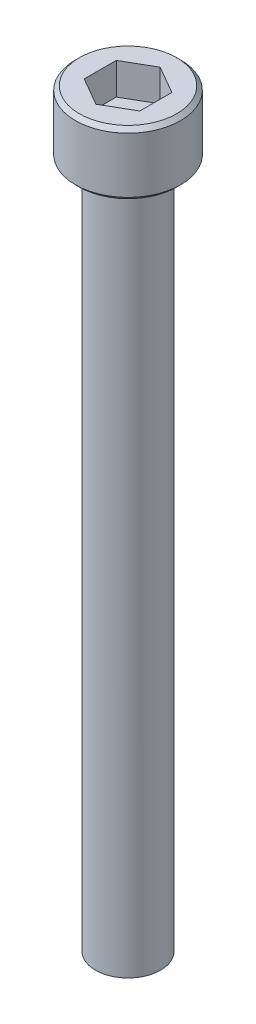
ISO-10303-21;
HEADER;
FILE_DESCRIPTION(('STEP AP214'),'2;1');
FILE_NAME('part.step','',(''),(''),'','','');
FILE_SCHEMA(('AUTOMOTIVE_DESIGN { 1 0 10303 214 1 1 1 1 }'));
ENDSEC;
DATA;
#1=APPLICATION_CONTEXT('core data for automotive mechanical design processes');
#2=APPLICATION_PROTOCOL_DEFINITION('international standard','automotive_design',2000,#1);
#3=PRODUCT_CONTEXT('',#1,'mechanical');
#4=PRODUCT('Part','Part','',(#3));
#5=PRODUCT_RELATED_PRODUCT_CATEGORY('part','',(#4));
#6=PRODUCT_DEFINITION_FORMATION('','',#4);
#7=PRODUCT_DEFINITION_CONTEXT('part definition',#1,'design');
#8=PRODUCT_DEFINITION('design','',#6,#7);
#9=PRODUCT_DEFINITION_SHAPE('','',#8);
#10=(LENGTH_UNIT() NAMED_UNIT(*) SI_UNIT(.MILLI.,.METRE.));
#11=(NAMED_UNIT(*) PLANE_ANGLE_UNIT() SI_UNIT($,.RADIAN.));
#12=(NAMED_UNIT(*) SI_UNIT($,.STERADIAN.) SOLID_ANGLE_UNIT());
#13=UNCERTAINTY_MEASURE_WITH_UNIT(LENGTH_MEASURE(1.E-05),#10,'distance_accuracy_value','');
#14=(GEOMETRIC_REPRESENTATION_CONTEXT(3) GLOBAL_UNCERTAINTY_ASSIGNED_CONTEXT((#13)) GLOBAL_UNIT_ASSIGNED_CONTEXT((#10,
#11,#12)) REPRESENTATION_CONTEXT('',''));
#15=CARTESIAN_POINT('',(0.,0.,0.));
#16=DIRECTION('',(0.,0.,1.));
#17=DIRECTION('',(1.,0.,0.));
#18=AXIS2_PLACEMENT_3D('',#15,#16,#17);
#19=CARTESIAN_POINT('',(1.778,2.032,3.07958633585746));
#20=DIRECTION('',(0.,1.,0.));
#21=DIRECTION('',(-1.,0.,0.));
#22=AXIS2_PLACEMENT_3D('',#19,#20,#21);
#23=PLANE('',#22);
#24=DIRECTION('',(-0.866025403784439,0.,0.5));
#25=VECTOR('',#24,1.);
#26=CARTESIAN_POINT('',(0.,2.032,-2.05305755723831));
#27=LINE('',#26,#25);
#28=CARTESIAN_POINT('',(0.,2.032,-2.05305755723831));
#29=VERTEX_POINT('',#28);
#30=CARTESIAN_POINT('',(-1.778,2.032,-1.02652877861914));
#31=VERTEX_POINT('',#30);
#32=EDGE_CURVE('E67',#29,#31,#27,.T.);
#33=ORIENTED_EDGE('',*,*,#32,.T.);
#34=DIRECTION('',(0.,0.,1.));
#35=VECTOR('',#34,1.);
#36=CARTESIAN_POINT('',(-1.778,2.032,-1.02652877861913));
#37=LINE('',#36,#35);
#38=CARTESIAN_POINT('',(-1.778,2.032,1.02652877861917));
#39=VERTEX_POINT('',#38);
#40=EDGE_CURVE('E69',#31,#39,#37,.T.);
#41=ORIENTED_EDGE('',*,*,#40,.T.);
#42=DIRECTION('',(0.866025403784439,0.,0.499999999999999));
#43=VECTOR('',#42,1.);
#44=CARTESIAN_POINT('',(-1.77799999999999,2.032,1.02652877861917));
#45=LINE('',#44,#43);
#46=CARTESIAN_POINT('',(0.,2.032,2.05305755723832));
#47=VERTEX_POINT('',#46);
#48=EDGE_CURVE('E71',#39,#47,#45,.T.);
#49=ORIENTED_EDGE('',*,*,#48,.T.);
#50=DIRECTION('',(0.866025403784439,0.,-0.5));
#51=VECTOR('',#50,1.);
#52=CARTESIAN_POINT('',(0.,2.032,2.05305755723831));
#53=LINE('',#52,#51);
#54=CARTESIAN_POINT('',(1.77800000000001,2.032,1.02652877861916));
#55=VERTEX_POINT('',#54);
#56=EDGE_CURVE('E126',#47,#55,#53,.T.);
#57=ORIENTED_EDGE('',*,*,#56,.T.);
#58=DIRECTION('',(0.,0.,-1.));
#59=VECTOR('',#58,1.);
#60=CARTESIAN_POINT('',(1.77800000000001,2.032,1.02652877861915));
#61=LINE('',#60,#59);
#62=CARTESIAN_POINT('',(1.77800000000001,2.032,-1.02652877861913));
#63=VERTEX_POINT('',#62);
#64=EDGE_CURVE('E131',#55,#63,#61,.T.);
#65=ORIENTED_EDGE('',*,*,#64,.T.);
#66=DIRECTION('',(-0.866025403784439,0.,-0.499999999999999));
#67=VECTOR('',#66,1.);
#68=CARTESIAN_POINT('',(1.77800000000001,2.032,-1.02652877861913));
#69=LINE('',#68,#67);
#70=EDGE_CURVE('E135',#63,#29,#69,.T.);
#71=ORIENTED_EDGE('',*,*,#70,.T.);
#72=EDGE_LOOP('',(#33,#41,#49,#57,#65,#71));
#73=FACE_BOUND('',#72,.T.);
#74=ADVANCED_FACE('F16',(#73),#23,.T.);
#75=CARTESIAN_POINT('',(-1.77799999999999,2.032,1.02652877861917));
#76=DIRECTION('',(-0.499999999999999,0.,0.866025403784439));
#77=DIRECTION('',(0.866025403784439,0.,0.499999999999999));
#78=AXIS2_PLACEMENT_3D('',#75,#76,#77);
#79=PLANE('',#78);
#80=DIRECTION('',(0.,1.,0.));
#81=VECTOR('',#80,1.);
#82=CARTESIAN_POINT('',(0.,2.032,2.05305755723831));
#83=LINE('',#82,#81);
#84=CARTESIAN_POINT('',(0.,4.064,2.05305755723832));
#85=VERTEX_POINT('',#84);
#86=EDGE_CURVE('E82',#85,#47,#83,.F.);
#87=ORIENTED_EDGE('',*,*,#86,.T.);
#88=ORIENTED_EDGE('',*,*,#48,.F.);
#89=DIRECTION('',(0.,1.,0.));
#90=VECTOR('',#89,1.);
#91=CARTESIAN_POINT('',(-1.778,2.032,1.02652877861917));
#92=LINE('',#91,#90);
#93=CARTESIAN_POINT('',(-1.77799999999999,4.064,1.02652877861917));
#94=VERTEX_POINT('',#93);
#95=EDGE_CURVE('E76',#39,#94,#92,.T.);
#96=ORIENTED_EDGE('',*,*,#95,.T.);
#97=DIRECTION('',(-0.866025403784442,0.,-0.499999999999994));
#98=VECTOR('',#97,1.);
#99=CARTESIAN_POINT('',(0.,4.064,2.05305755723831));
#100=LINE('',#99,#98);
#101=EDGE_CURVE('E123',#85,#94,#100,.T.);
#102=ORIENTED_EDGE('',*,*,#101,.F.);
#103=EDGE_LOOP('',(#87,#88,#96,#102));
#104=FACE_BOUND('',#103,.T.);
#105=ADVANCED_FACE('F79',(#104),#79,.F.);
#106=CARTESIAN_POINT('',(-1.778,2.032,-1.02652877861913));
#107=DIRECTION('',(-1.,0.,0.));
#108=DIRECTION('',(0.,0.,1.));
#109=AXIS2_PLACEMENT_3D('',#106,#107,#108);
#110=PLANE('',#109);
#111=ORIENTED_EDGE('',*,*,#95,.F.);
#112=ORIENTED_EDGE('',*,*,#40,.F.);
#113=DIRECTION('',(0.,1.,0.));
#114=VECTOR('',#113,1.);
#115=CARTESIAN_POINT('',(-1.77800000000001,2.032,-1.02652877861915));
#116=LINE('',#115,#114);
#117=CARTESIAN_POINT('',(-1.778,4.064,-1.02652877861914));
#118=VERTEX_POINT('',#117);
#119=EDGE_CURVE('E90',#31,#118,#116,.T.);
#120=ORIENTED_EDGE('',*,*,#119,.T.);
#121=DIRECTION('',(0.,0.,1.));
#122=VECTOR('',#121,1.);
#123=CARTESIAN_POINT('',(-1.77799999999999,4.064,0.));
#124=LINE('',#123,#122);
#125=EDGE_CURVE('E87',#94,#118,#124,.F.);
#126=ORIENTED_EDGE('',*,*,#125,.F.);
#127=EDGE_LOOP('',(#111,#112,#120,#126));
#128=FACE_BOUND('',#127,.T.);
#129=ADVANCED_FACE('F85',(#128),#110,.F.);
#130=CARTESIAN_POINT('',(0.,2.032,-2.05305755723831));
#131=DIRECTION('',(-0.5,0.,-0.866025403784439));
#132=DIRECTION('',(-0.866025403784439,0.,0.5));
#133=AXIS2_PLACEMENT_3D('',#130,#131,#132);
#134=PLANE('',#133);
#135=ORIENTED_EDGE('',*,*,#119,.F.);
#136=ORIENTED_EDGE('',*,*,#32,.F.);
#137=DIRECTION('',(0.,1.,0.));
#138=VECTOR('',#137,1.);
#139=CARTESIAN_POINT('',(0.,2.032,-2.05305755723829));
#140=LINE('',#139,#138);
#141=CARTESIAN_POINT('',(0.,4.064,-2.05305755723831));
#142=VERTEX_POINT('',#141);
#143=EDGE_CURVE('E133',#29,#142,#140,.T.);
#144=ORIENTED_EDGE('',*,*,#143,.T.);
#145=DIRECTION('',(0.866025403784434,0.,-0.500000000000007));
#146=VECTOR('',#145,1.);
#147=CARTESIAN_POINT('',(-1.778,4.064,-1.02652877861913));
#148=LINE('',#147,#146);
#149=EDGE_CURVE('E119',#118,#142,#148,.T.);
#150=ORIENTED_EDGE('',*,*,#149,.F.);
#151=EDGE_LOOP('',(#135,#136,#144,#150));
#152=FACE_BOUND('',#151,.T.);
#153=ADVANCED_FACE('F138',(#152),#134,.F.);
#154=CARTESIAN_POINT('',(1.77800000000001,2.032,-1.02652877861913));
#155=DIRECTION('',(0.499999999999999,0.,-0.866025403784439));
#156=DIRECTION('',(-0.866025403784439,0.,-0.499999999999999));
#157=AXIS2_PLACEMENT_3D('',#154,#155,#156);
#158=PLANE('',#157);
#159=ORIENTED_EDGE('',*,*,#143,.F.);
#160=ORIENTED_EDGE('',*,*,#70,.F.);
#161=DIRECTION('',(0.,1.,0.));
#162=VECTOR('',#161,1.);
#163=CARTESIAN_POINT('',(1.77800000000001,2.032,-1.02652877861913));
#164=LINE('',#163,#162);
#165=CARTESIAN_POINT('',(1.77800000000001,4.064,-1.02652877861913));
#166=VERTEX_POINT('',#165);
#167=EDGE_CURVE('E129',#63,#166,#164,.T.);
#168=ORIENTED_EDGE('',*,*,#167,.T.);
#169=DIRECTION('',(0.866025403784432,0.,0.500000000000011));
#170=VECTOR('',#169,1.);
#171=CARTESIAN_POINT('',(0.,4.064,-2.05305755723831));
#172=LINE('',#171,#170);
#173=EDGE_CURVE('E116',#142,#166,#172,.T.);
#174=ORIENTED_EDGE('',*,*,#173,.F.);
#175=EDGE_LOOP('',(#159,#160,#168,#174));
#176=FACE_BOUND('',#175,.T.);
#177=ADVANCED_FACE('F150',(#176),#158,.F.);
#178=CARTESIAN_POINT('',(1.77800000000001,2.032,1.02652877861915));
#179=DIRECTION('',(1.,0.,0.));
#180=DIRECTION('',(0.,0.,-1.));
#181=AXIS2_PLACEMENT_3D('',#178,#179,#180);
#182=PLANE('',#181);
#183=ORIENTED_EDGE('',*,*,#167,.F.);
#184=ORIENTED_EDGE('',*,*,#64,.F.);
#185=DIRECTION('',(0.,1.,0.));
#186=VECTOR('',#185,1.);
#187=CARTESIAN_POINT('',(1.77800000000001,2.032,1.02652877861916));
#188=LINE('',#187,#186);
#189=CARTESIAN_POINT('',(1.77800000000001,4.064,1.02652877861916));
#190=VERTEX_POINT('',#189);
#191=EDGE_CURVE('E34',#55,#190,#188,.T.);
#192=ORIENTED_EDGE('',*,*,#191,.T.);
#193=DIRECTION('',(0.,0.,1.));
#194=VECTOR('',#193,1.);
#195=CARTESIAN_POINT('',(1.77800000000001,4.064,0.));
#196=LINE('',#195,#194);
#197=EDGE_CURVE('E113',#166,#190,#196,.T.);
#198=ORIENTED_EDGE('',*,*,#197,.F.);
#199=EDGE_LOOP('',(#183,#184,#192,#198));
#200=FACE_BOUND('',#199,.T.);
#201=ADVANCED_FACE('F148',(#200),#182,.F.);
#202=CARTESIAN_POINT('',(0.,2.032,2.05305755723831));
#203=DIRECTION('',(0.5,0.,0.866025403784439));
#204=DIRECTION('',(0.866025403784439,0.,-0.5));
#205=AXIS2_PLACEMENT_3D('',#202,#203,#204);
#206=PLANE('',#205);
#207=ORIENTED_EDGE('',*,*,#191,.F.);
#208=ORIENTED_EDGE('',*,*,#56,.F.);
#209=ORIENTED_EDGE('',*,*,#86,.F.);
#210=DIRECTION('',(-0.866025403784437,0.,0.500000000000003));
#211=VECTOR('',#210,1.);
#212=CARTESIAN_POINT('',(1.77800000000001,4.064,1.02652877861915));
#213=LINE('',#212,#211);
#214=EDGE_CURVE('E110',#190,#85,#213,.T.);
#215=ORIENTED_EDGE('',*,*,#214,.F.);
#216=EDGE_LOOP('',(#207,#208,#209,#215));
#217=FACE_BOUND('',#216,.T.);
#218=ADVANCED_FACE('F145',(#217),#206,.F.);
#219=CARTESIAN_POINT('',(0.,4.064,0.));
#220=DIRECTION('',(0.,1.,0.));
#221=DIRECTION('',(-1.,0.,0.));
#222=AXIS2_PLACEMENT_3D('',#219,#220,#221);
#223=PLANE('',#222);
#224=ORIENTED_EDGE('',*,*,#197,.T.);
#225=ORIENTED_EDGE('',*,*,#214,.T.);
#226=ORIENTED_EDGE('',*,*,#101,.T.);
#227=ORIENTED_EDGE('',*,*,#125,.T.);
#228=ORIENTED_EDGE('',*,*,#149,.T.);
#229=ORIENTED_EDGE('',*,*,#173,.T.);
#230=EDGE_LOOP('',(#224,#225,#226,#227,#228,#229));
#231=FACE_BOUND('',#230,.T.);
#232=CARTESIAN_POINT('',(0.,4.06400000002805,0.));
#233=DIRECTION('',(0.,-1.,0.));
#234=DIRECTION('',(1.,0.,0.));
#235=AXIS2_PLACEMENT_3D('',#232,#233,#234);
#236=CIRCLE('',#235,3.11149999998861);
#237=CARTESIAN_POINT('',(3.11149999998861,4.06400000002805,0.));
#238=VERTEX_POINT('',#237);
#239=EDGE_CURVE('E19',#238,#238,#236,.T.);
#240=ORIENTED_EDGE('',*,*,#239,.F.);
#241=EDGE_LOOP('',(#240));
#242=FACE_BOUND('',#241,.T.);
#243=ADVANCED_FACE('F142',(#231,#242),#223,.T.);
#244=CARTESIAN_POINT('',(0.,3.81000000004406,0.));
#245=DIRECTION('',(0.,-1.,0.));
#246=DIRECTION('',(1.,0.,0.));
#247=AXIS2_PLACEMENT_3D('',#244,#245,#246);
#248=CONICAL_SURFACE('',#247,3.3654999999726,0.785398163397448);
#249=ORIENTED_EDGE('',*,*,#239,.T.);
#250=EDGE_LOOP('',(#249));
#251=FACE_BOUND('',#250,.T.);
#252=CARTESIAN_POINT('',(0.,3.81000000000001,0.));
#253=DIRECTION('',(0.,-1.,0.));
#254=DIRECTION('',(1.,0.,0.));
#255=AXIS2_PLACEMENT_3D('',#252,#253,#254);
#256=CIRCLE('',#255,3.3655);
#257=CARTESIAN_POINT('',(3.3655,3.81000000000001,0.));
#258=VERTEX_POINT('',#257);
#259=EDGE_CURVE('E102',#258,#258,#256,.T.);
#260=ORIENTED_EDGE('',*,*,#259,.F.);
#261=EDGE_LOOP('',(#260));
#262=FACE_BOUND('',#261,.T.);
#263=ADVANCED_FACE('F187',(#251,#262),#248,.T.);
#264=CARTESIAN_POINT('',(0.,4.064,0.));
#265=DIRECTION('',(0.,-1.,0.));
#266=DIRECTION('',(1.,0.,0.));
#267=AXIS2_PLACEMENT_3D('',#264,#265,#266);
#268=CYLINDRICAL_SURFACE('',#267,3.3655);
#269=ORIENTED_EDGE('',*,*,#259,.T.);
#270=EDGE_LOOP('',(#269));
#271=FACE_BOUND('',#270,.T.);
#272=CARTESIAN_POINT('',(0.,0.254000000097676,0.));
#273=DIRECTION('',(0.,1.,0.));
#274=DIRECTION('',(0.,0.,1.));
#275=AXIS2_PLACEMENT_3D('',#272,#273,#274);
#276=CIRCLE('',#275,3.36550000008629);
#277=CARTESIAN_POINT('',(0.,0.254000000097676,3.36550000008629));
#278=VERTEX_POINT('',#277);
#279=EDGE_CURVE('E98',#278,#278,#276,.F.);
#280=ORIENTED_EDGE('',*,*,#279,.F.);
#281=EDGE_LOOP('',(#280));
#282=FACE_BOUND('',#281,.T.);
#283=ADVANCED_FACE('F183',(#271,#282),#268,.T.);
#284=CARTESIAN_POINT('',(0.,-44.45,0.));
#285=DIRECTION('',(0.,1.,0.));
#286=DIRECTION('',(-1.,0.,0.));
#287=AXIS2_PLACEMENT_3D('',#284,#285,#286);
#288=PLANE('',#287);
#289=CARTESIAN_POINT('',(0.,-44.4499999999834,0.));
#290=DIRECTION('',(0.,1.,0.));
#291=DIRECTION('',(0.,0.,1.));
#292=AXIS2_PLACEMENT_3D('',#289,#290,#291);
#293=CIRCLE('',#292,1.31318000001102);
#294=CARTESIAN_POINT('',(0.,-44.4499999999834,1.31318000001102));
#295=VERTEX_POINT('',#294);
#296=EDGE_CURVE('E96',#295,#295,#293,.T.);
#297=ORIENTED_EDGE('',*,*,#296,.F.);
#298=EDGE_LOOP('',(#297));
#299=FACE_BOUND('',#298,.T.);
#300=ADVANCED_FACE('F179',(#299),#288,.F.);
#301=CARTESIAN_POINT('',(0.,0.253999999927146,0.));
#302=DIRECTION('',(0.,1.,0.));
#303=DIRECTION('',(0.,0.,1.));
#304=AXIS2_PLACEMENT_3D('',#301,#302,#303);
#305=CONICAL_SURFACE('',#304,3.36549999991576,0.785398163397448);
#306=CARTESIAN_POINT('',(0.,0.,0.));
#307=DIRECTION('',(0.,1.,0.));
#308=DIRECTION('',(0.,0.,1.));
#309=AXIS2_PLACEMENT_3D('',#306,#307,#308);
#310=CIRCLE('',#309,3.11149999998861);
#311=CARTESIAN_POINT('',(0.,0.,3.11149999998861));
#312=VERTEX_POINT('',#311);
#313=EDGE_CURVE('E94',#312,#312,#310,.T.);
#314=ORIENTED_EDGE('',*,*,#313,.T.);
#315=EDGE_LOOP('',(#314));
#316=FACE_BOUND('',#315,.T.);
#317=ORIENTED_EDGE('',*,*,#279,.T.);
#318=EDGE_LOOP('',(#317));
#319=FACE_BOUND('',#318,.T.);
#320=ADVANCED_FACE('F175',(#316,#319),#305,.T.);
#321=CARTESIAN_POINT('',(0.,-43.9115199999947,0.));
#322=DIRECTION('',(0.,1.,0.));
#323=DIRECTION('',(0.,0.,1.));
#324=AXIS2_PLACEMENT_3D('',#321,#322,#323);
#325=CONICAL_SURFACE('',#324,2.0827999999824,0.960291895402791);
#326=CARTESIAN_POINT('',(0.,-43.91152,0.));
#327=DIRECTION('',(0.,1.,0.));
#328=DIRECTION('',(-1.,0.,0.));
#329=AXIS2_PLACEMENT_3D('',#326,#327,#328);
#330=CIRCLE('',#329,2.0828);
#331=CARTESIAN_POINT('',(-2.0828,-43.91152,0.));
#332=VERTEX_POINT('',#331);
#333=EDGE_CURVE('E25',#332,#332,#330,.T.);
#334=ORIENTED_EDGE('',*,*,#333,.F.);
#335=EDGE_LOOP('',(#334));
#336=FACE_BOUND('',#335,.T.);
#337=ORIENTED_EDGE('',*,*,#296,.T.);
#338=EDGE_LOOP('',(#337));
#339=FACE_BOUND('',#338,.T.);
#340=ADVANCED_FACE('F168',(#336,#339),#325,.T.);
#341=CARTESIAN_POINT('',(0.,0.,0.));
#342=DIRECTION('',(0.,1.,0.));
#343=DIRECTION('',(-1.,0.,0.));
#344=AXIS2_PLACEMENT_3D('',#341,#342,#343);
#345=PLANE('',#344);
#346=CARTESIAN_POINT('',(0.,0.,0.));
#347=DIRECTION('',(0.,1.,0.));
#348=DIRECTION('',(-1.,0.,0.));
#349=AXIS2_PLACEMENT_3D('',#346,#347,#348);
#350=CIRCLE('',#349,2.0828);
#351=CARTESIAN_POINT('',(-2.0828,0.,0.));
#352=VERTEX_POINT('',#351);
#353=EDGE_CURVE('E11',#352,#352,#350,.F.);
#354=ORIENTED_EDGE('',*,*,#353,.F.);
#355=EDGE_LOOP('',(#354));
#356=FACE_BOUND('',#355,.T.);
#357=ORIENTED_EDGE('',*,*,#313,.F.);
#358=EDGE_LOOP('',(#357));
#359=FACE_BOUND('',#358,.T.);
#360=ADVANCED_FACE('F162',(#356,#359),#345,.F.);
#361=CARTESIAN_POINT('',(0.,-44.45,0.));
#362=DIRECTION('',(0.,1.,0.));
#363=DIRECTION('',(-1.,0.,0.));
#364=AXIS2_PLACEMENT_3D('',#361,#362,#363);
#365=CYLINDRICAL_SURFACE('',#364,2.0828);
#366=ORIENTED_EDGE('',*,*,#353,.T.);
#367=EDGE_LOOP('',(#366));
#368=FACE_BOUND('',#367,.T.);
#369=ORIENTED_EDGE('',*,*,#333,.T.);
#370=EDGE_LOOP('',(#369));
#371=FACE_BOUND('',#370,.T.);
#372=ADVANCED_FACE('F160',(#368,#371),#365,.T.);
#373=CLOSED_SHELL('',(#74,#105,#129,#153,#177,#201,#218,#243,#263,#283,#300,#320,#340,#360,#372));
#374=MANIFOLD_SOLID_BREP('B1',#373);
#375=ADVANCED_BREP_SHAPE_REPRESENTATION('',(#18,#374),#14);
#376=SHAPE_DEFINITION_REPRESENTATION(#9,#375);
ENDSEC;
END-ISO-10303-21;
